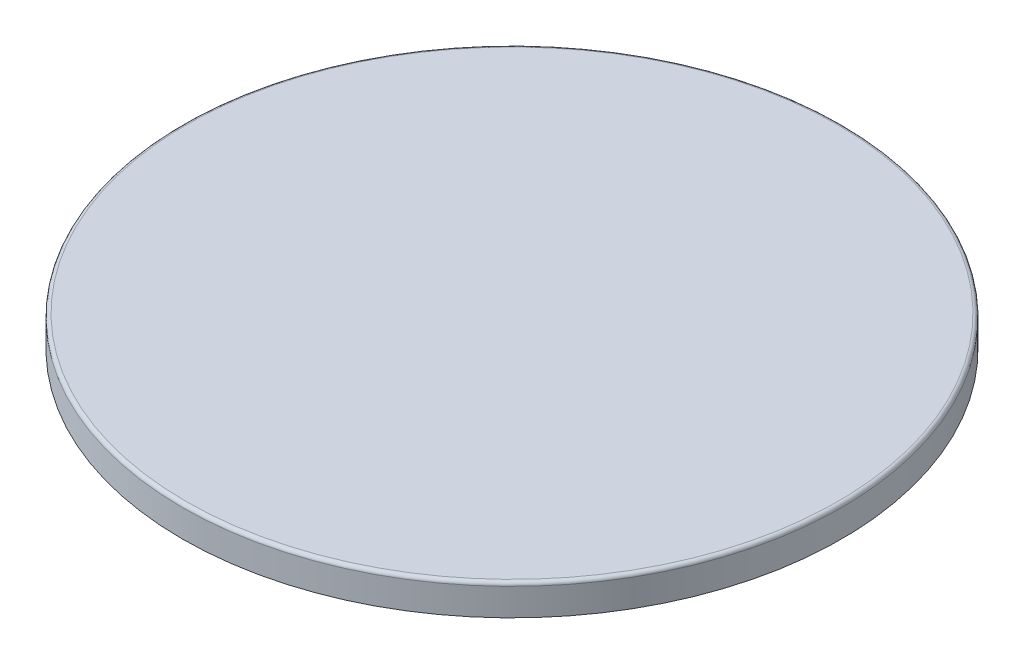
ISO-10303-21;
HEADER;
FILE_DESCRIPTION(('STEP AP214'),'2;1');
FILE_NAME('part.step','',(''),(''),'','','');
FILE_SCHEMA(('AUTOMOTIVE_DESIGN { 1 0 10303 214 1 1 1 1 }'));
ENDSEC;
DATA;
#1=APPLICATION_CONTEXT('core data for automotive mechanical design processes');
#2=APPLICATION_PROTOCOL_DEFINITION('international standard','automotive_design',2000,#1);
#3=PRODUCT_CONTEXT('',#1,'mechanical');
#4=PRODUCT('Part','Part','',(#3));
#5=PRODUCT_RELATED_PRODUCT_CATEGORY('part','',(#4));
#6=PRODUCT_DEFINITION_FORMATION('','',#4);
#7=PRODUCT_DEFINITION_CONTEXT('part definition',#1,'design');
#8=PRODUCT_DEFINITION('design','',#6,#7);
#9=PRODUCT_DEFINITION_SHAPE('','',#8);
#10=(LENGTH_UNIT() NAMED_UNIT(*) SI_UNIT(.MILLI.,.METRE.));
#11=(NAMED_UNIT(*) PLANE_ANGLE_UNIT() SI_UNIT($,.RADIAN.));
#12=(NAMED_UNIT(*) SI_UNIT($,.STERADIAN.) SOLID_ANGLE_UNIT());
#13=UNCERTAINTY_MEASURE_WITH_UNIT(LENGTH_MEASURE(1.E-05),#10,'distance_accuracy_value','');
#14=(GEOMETRIC_REPRESENTATION_CONTEXT(3) GLOBAL_UNCERTAINTY_ASSIGNED_CONTEXT((#13)) GLOBAL_UNIT_ASSIGNED_CONTEXT((#10,
#11,#12)) REPRESENTATION_CONTEXT('',''));
#15=CARTESIAN_POINT('',(0.,0.,0.));
#16=DIRECTION('',(0.,0.,1.));
#17=DIRECTION('',(1.,0.,0.));
#18=AXIS2_PLACEMENT_3D('',#15,#16,#17);
#19=CARTESIAN_POINT('',(0.,-1.,0.));
#20=DIRECTION('',(0.,1.,0.));
#21=DIRECTION('',(0.,0.,1.));
#22=AXIS2_PLACEMENT_3D('',#19,#20,#21);
#23=PLANE('',#22);
#24=CARTESIAN_POINT('',(0.,-1.,0.));
#25=DIRECTION('',(0.,1.,0.));
#26=DIRECTION('',(0.,0.,1.));
#27=AXIS2_PLACEMENT_3D('',#24,#25,#26);
#28=CIRCLE('',#27,158.5);
#29=CARTESIAN_POINT('',(0.,-1.,158.5));
#30=VERTEX_POINT('',#29);
#31=EDGE_CURVE('E12',#30,#30,#28,.T.);
#32=ORIENTED_EDGE('',*,*,#31,.F.);
#33=EDGE_LOOP('',(#32));
#34=FACE_BOUND('',#33,.T.);
#35=ADVANCED_FACE('F90',(#34),#23,.F.);
#36=CARTESIAN_POINT('',(0.,-15.,0.));
#37=DIRECTION('',(0.,-1.,0.));
#38=DIRECTION('',(0.,0.,-1.));
#39=AXIS2_PLACEMENT_3D('',#36,#37,#38);
#40=PLANE('',#39);
#41=CARTESIAN_POINT('',(0.,-15.,0.));
#42=DIRECTION('',(0.,1.,0.));
#43=DIRECTION('',(0.,0.,1.));
#44=AXIS2_PLACEMENT_3D('',#41,#42,#43);
#45=CIRCLE('',#44,159.2366);
#46=CARTESIAN_POINT('',(0.,-15.,159.2366));
#47=VERTEX_POINT('',#46);
#48=EDGE_CURVE('E126',#47,#47,#45,.T.);
#49=ORIENTED_EDGE('',*,*,#48,.T.);
#50=EDGE_LOOP('',(#49));
#51=FACE_BOUND('',#50,.T.);
#52=CARTESIAN_POINT('',(0.,-15.,0.));
#53=DIRECTION('',(0.,1.,0.));
#54=DIRECTION('',(0.,0.,1.));
#55=AXIS2_PLACEMENT_3D('',#52,#53,#54);
#56=CIRCLE('',#55,160.2366);
#57=CARTESIAN_POINT('',(0.,-15.,160.2366));
#58=VERTEX_POINT('',#57);
#59=EDGE_CURVE('E127',#58,#58,#56,.T.);
#60=ORIENTED_EDGE('',*,*,#59,.F.);
#61=EDGE_LOOP('',(#60));
#62=FACE_BOUND('',#61,.T.);
#63=ADVANCED_FACE('F124',(#51,#62),#40,.T.);
#64=CARTESIAN_POINT('',(0.,-1.,0.));
#65=DIRECTION('',(0.,1.,0.));
#66=DIRECTION('',(0.,0.,1.));
#67=AXIS2_PLACEMENT_3D('',#64,#65,#66);
#68=CYLINDRICAL_SURFACE('',#67,160.2366);
#69=DIRECTION('',(0.,1.,0.));
#70=VECTOR('',#69,1.);
#71=CARTESIAN_POINT('',(0.,-1.,160.2366));
#72=LINE('',#71,#70);
#73=CARTESIAN_POINT('',(0.,-1.7366,160.2366));
#74=VERTEX_POINT('',#73);
#75=EDGE_CURVE('E142',#74,#58,#72,.F.);
#76=ORIENTED_EDGE('',*,*,#75,.F.);
#77=CARTESIAN_POINT('',(0.,-1.7366,0.));
#78=DIRECTION('',(0.,1.,0.));
#79=DIRECTION('',(0.,0.,1.));
#80=AXIS2_PLACEMENT_3D('',#77,#78,#79);
#81=CIRCLE('',#80,160.2366);
#82=EDGE_CURVE('E144',#74,#74,#81,.T.);
#83=ORIENTED_EDGE('',*,*,#82,.F.);
#84=ORIENTED_EDGE('',*,*,#75,.T.);
#85=ORIENTED_EDGE('',*,*,#59,.T.);
#86=EDGE_LOOP('',(#76,#83,#84,#85));
#87=FACE_BOUND('',#86,.T.);
#88=ADVANCED_FACE('F152',(#87),#68,.T.);
#89=CARTESIAN_POINT('',(0.,-1.7366,0.));
#90=DIRECTION('',(0.,1.,0.));
#91=DIRECTION('',(0.,0.,1.));
#92=AXIS2_PLACEMENT_3D('',#89,#90,#91);
#93=TOROIDAL_SURFACE('',#92,158.5,1.7366);
#94=CARTESIAN_POINT('',(0.,-1.7366,158.5));
#95=DIRECTION('',(-1.,0.,0.));
#96=DIRECTION('',(0.,0.,1.));
#97=AXIS2_PLACEMENT_3D('',#94,#95,#96);
#98=CIRCLE('',#97,1.7366);
#99=CARTESIAN_POINT('',(0.,0.,158.5));
#100=VERTEX_POINT('',#99);
#101=EDGE_CURVE('E105',#100,#74,#98,.F.);
#102=ORIENTED_EDGE('',*,*,#101,.F.);
#103=CARTESIAN_POINT('',(0.,0.,0.));
#104=DIRECTION('',(0.,1.,0.));
#105=DIRECTION('',(0.,0.,1.));
#106=AXIS2_PLACEMENT_3D('',#103,#104,#105);
#107=CIRCLE('',#106,158.5);
#108=EDGE_CURVE('E94',#100,#100,#107,.T.);
#109=ORIENTED_EDGE('',*,*,#108,.F.);
#110=ORIENTED_EDGE('',*,*,#101,.T.);
#111=ORIENTED_EDGE('',*,*,#82,.T.);
#112=EDGE_LOOP('',(#102,#109,#110,#111));
#113=FACE_BOUND('',#112,.T.);
#114=ADVANCED_FACE('F151',(#113),#93,.T.);
#115=CARTESIAN_POINT('',(0.,-1.,0.));
#116=DIRECTION('',(0.,1.,0.));
#117=DIRECTION('',(0.,0.,1.));
#118=AXIS2_PLACEMENT_3D('',#115,#116,#117);
#119=CYLINDRICAL_SURFACE('',#118,159.2366);
#120=DIRECTION('',(0.,-1.,0.));
#121=VECTOR('',#120,1.);
#122=CARTESIAN_POINT('',(0.,-1.,159.2366));
#123=LINE('',#122,#121);
#124=CARTESIAN_POINT('',(0.,-1.7366,159.2366));
#125=VERTEX_POINT('',#124);
#126=EDGE_CURVE('E133',#125,#47,#123,.T.);
#127=ORIENTED_EDGE('',*,*,#126,.T.);
#128=ORIENTED_EDGE('',*,*,#48,.F.);
#129=ORIENTED_EDGE('',*,*,#126,.F.);
#130=CARTESIAN_POINT('',(0.,-1.7366,0.));
#131=DIRECTION('',(0.,1.,0.));
#132=DIRECTION('',(0.,0.,1.));
#133=AXIS2_PLACEMENT_3D('',#130,#131,#132);
#134=CIRCLE('',#133,159.2366);
#135=EDGE_CURVE('E136',#125,#125,#134,.T.);
#136=ORIENTED_EDGE('',*,*,#135,.T.);
#137=EDGE_LOOP('',(#127,#128,#129,#136));
#138=FACE_BOUND('',#137,.T.);
#139=ADVANCED_FACE('F134',(#138),#119,.F.);
#140=CARTESIAN_POINT('',(0.,-1.7366,0.));
#141=DIRECTION('',(0.,1.,0.));
#142=DIRECTION('',(0.,0.,1.));
#143=AXIS2_PLACEMENT_3D('',#140,#141,#142);
#144=TOROIDAL_SURFACE('',#143,158.5,0.7366);
#145=CARTESIAN_POINT('',(0.,-1.7366,158.5));
#146=DIRECTION('',(-1.,0.,0.));
#147=DIRECTION('',(0.,0.,1.));
#148=AXIS2_PLACEMENT_3D('',#145,#146,#147);
#149=CIRCLE('',#148,0.7366);
#150=EDGE_CURVE('E137',#30,#125,#149,.F.);
#151=ORIENTED_EDGE('',*,*,#150,.T.);
#152=ORIENTED_EDGE('',*,*,#135,.F.);
#153=ORIENTED_EDGE('',*,*,#150,.F.);
#154=ORIENTED_EDGE('',*,*,#31,.T.);
#155=EDGE_LOOP('',(#151,#152,#153,#154));
#156=FACE_BOUND('',#155,.T.);
#157=ADVANCED_FACE('F168',(#156),#144,.F.);
#158=CARTESIAN_POINT('',(0.,0.,0.));
#159=DIRECTION('',(0.,1.,0.));
#160=DIRECTION('',(0.,0.,1.));
#161=AXIS2_PLACEMENT_3D('',#158,#159,#160);
#162=PLANE('',#161);
#163=ORIENTED_EDGE('',*,*,#108,.T.);
#164=EDGE_LOOP('',(#163));
#165=FACE_BOUND('',#164,.T.);
#166=ADVANCED_FACE('F92',(#165),#162,.T.);
#167=CLOSED_SHELL('',(#35,#63,#88,#114,#139,#157,#166));
#168=MANIFOLD_SOLID_BREP('B2',#167);
#169=ADVANCED_BREP_SHAPE_REPRESENTATION('',(#18,#168),#14);
#170=SHAPE_DEFINITION_REPRESENTATION(#9,#169);
ENDSEC;
END-ISO-10303-21;
